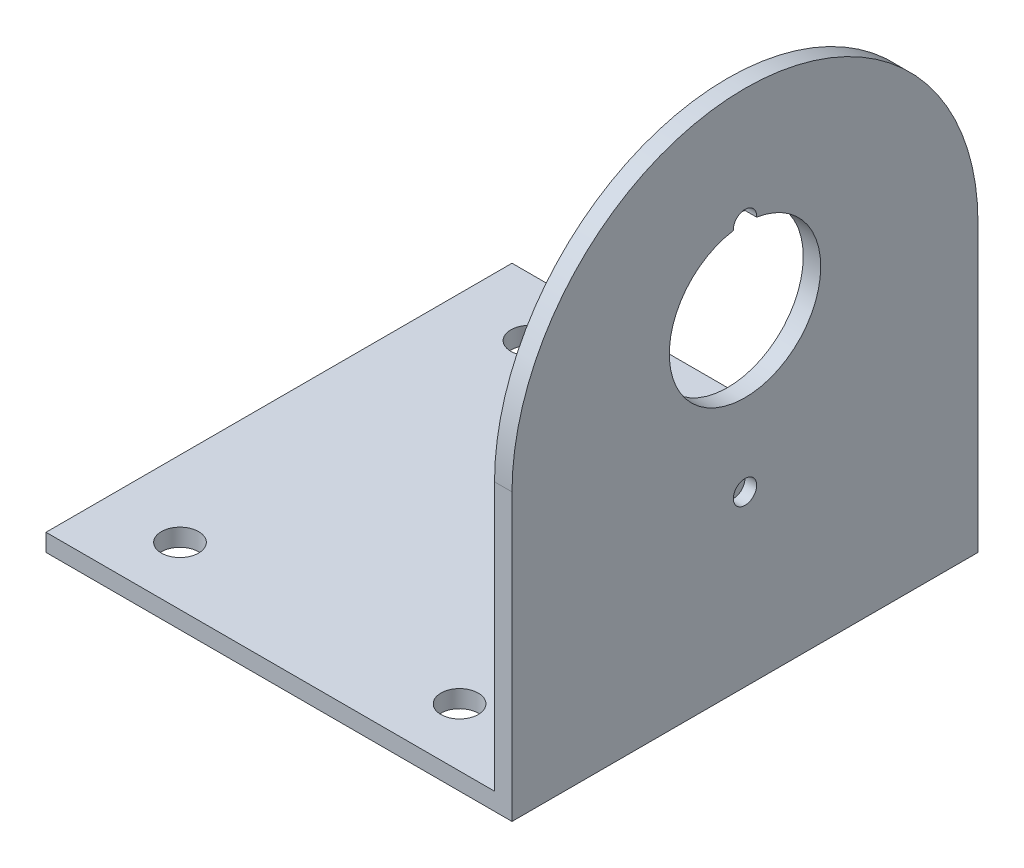
ISO-10303-21;
HEADER;
FILE_DESCRIPTION(('STEP AP214'),'2;1');
FILE_NAME('part.step','',(''),(''),'','','');
FILE_SCHEMA(('AUTOMOTIVE_DESIGN { 1 0 10303 214 1 1 1 1 }'));
ENDSEC;
DATA;
#1=APPLICATION_CONTEXT('core data for automotive mechanical design processes');
#2=APPLICATION_PROTOCOL_DEFINITION('international standard','automotive_design',2000,#1);
#3=PRODUCT_CONTEXT('',#1,'mechanical');
#4=PRODUCT('Part','Part','',(#3));
#5=PRODUCT_RELATED_PRODUCT_CATEGORY('part','',(#4));
#6=PRODUCT_DEFINITION_FORMATION('','',#4);
#7=PRODUCT_DEFINITION_CONTEXT('part definition',#1,'design');
#8=PRODUCT_DEFINITION('design','',#6,#7);
#9=PRODUCT_DEFINITION_SHAPE('','',#8);
#10=(LENGTH_UNIT() NAMED_UNIT(*) SI_UNIT(.MILLI.,.METRE.));
#11=(NAMED_UNIT(*) PLANE_ANGLE_UNIT() SI_UNIT($,.RADIAN.));
#12=(NAMED_UNIT(*) SI_UNIT($,.STERADIAN.) SOLID_ANGLE_UNIT());
#13=UNCERTAINTY_MEASURE_WITH_UNIT(LENGTH_MEASURE(1.E-05),#10,'distance_accuracy_value','');
#14=(GEOMETRIC_REPRESENTATION_CONTEXT(3) GLOBAL_UNCERTAINTY_ASSIGNED_CONTEXT((#13)) GLOBAL_UNIT_ASSIGNED_CONTEXT((#10,
#11,#12)) REPRESENTATION_CONTEXT('',''));
#15=CARTESIAN_POINT('',(0.,0.,0.));
#16=DIRECTION('',(0.,0.,1.));
#17=DIRECTION('',(1.,0.,0.));
#18=AXIS2_PLACEMENT_3D('',#15,#16,#17);
#19=CARTESIAN_POINT('',(0.,1.5,0.));
#20=DIRECTION('',(0.,1.,0.));
#21=DIRECTION('',(0.,0.,1.));
#22=AXIS2_PLACEMENT_3D('',#19,#20,#21);
#23=PLANE('',#22);
#24=CARTESIAN_POINT('',(5.49999999999999,1.5,-7.5));
#25=DIRECTION('',(0.,1.,0.));
#26=DIRECTION('',(0.,0.,1.));
#27=AXIS2_PLACEMENT_3D('',#24,#25,#26);
#28=CIRCLE('',#27,1.6);
#29=CARTESIAN_POINT('',(5.49999999999999,1.5,-5.9));
#30=VERTEX_POINT('',#29);
#31=EDGE_CURVE('E153',#30,#30,#28,.T.);
#32=ORIENTED_EDGE('',*,*,#31,.F.);
#33=EDGE_LOOP('',(#32));
#34=FACE_BOUND('',#33,.T.);
#35=CARTESIAN_POINT('',(-18.5,1.5,22.5));
#36=DIRECTION('',(0.,1.,0.));
#37=DIRECTION('',(0.,0.,1.));
#38=AXIS2_PLACEMENT_3D('',#35,#36,#37);
#39=CIRCLE('',#38,1.6);
#40=CARTESIAN_POINT('',(-18.5,1.5,24.1));
#41=VERTEX_POINT('',#40);
#42=EDGE_CURVE('E150',#41,#41,#39,.T.);
#43=ORIENTED_EDGE('',*,*,#42,.F.);
#44=EDGE_LOOP('',(#43));
#45=FACE_BOUND('',#44,.T.);
#46=CARTESIAN_POINT('',(-18.5,1.5,-7.5));
#47=DIRECTION('',(0.,1.,0.));
#48=DIRECTION('',(0.,0.,1.));
#49=AXIS2_PLACEMENT_3D('',#46,#47,#48);
#50=CIRCLE('',#49,1.6);
#51=CARTESIAN_POINT('',(-18.5,1.5,-5.9));
#52=VERTEX_POINT('',#51);
#53=EDGE_CURVE('E147',#52,#52,#50,.T.);
#54=ORIENTED_EDGE('',*,*,#53,.F.);
#55=EDGE_LOOP('',(#54));
#56=FACE_BOUND('',#55,.T.);
#57=CARTESIAN_POINT('',(5.49999999999999,1.5,22.5));
#58=DIRECTION('',(0.,1.,0.));
#59=DIRECTION('',(0.,0.,1.));
#60=AXIS2_PLACEMENT_3D('',#57,#58,#59);
#61=CIRCLE('',#60,1.6);
#62=CARTESIAN_POINT('',(5.49999999999999,1.5,24.1));
#63=VERTEX_POINT('',#62);
#64=EDGE_CURVE('E144',#63,#63,#61,.T.);
#65=ORIENTED_EDGE('',*,*,#64,.F.);
#66=EDGE_LOOP('',(#65));
#67=FACE_BOUND('',#66,.T.);
#68=DIRECTION('',(1.,0.,0.));
#69=VECTOR('',#68,1.);
#70=CARTESIAN_POINT('',(15.,1.5,27.5));
#71=LINE('',#70,#69);
#72=CARTESIAN_POINT('',(-25.,1.5,27.5));
#73=VERTEX_POINT('',#72);
#74=CARTESIAN_POINT('',(13.5,1.5,27.5));
#75=VERTEX_POINT('',#74);
#76=EDGE_CURVE('E178',#73,#75,#71,.T.);
#77=ORIENTED_EDGE('',*,*,#76,.T.);
#78=DIRECTION('',(0.,0.,-1.));
#79=VECTOR('',#78,1.);
#80=CARTESIAN_POINT('',(13.5,1.5,27.5));
#81=LINE('',#80,#79);
#82=CARTESIAN_POINT('',(13.5,1.5,-12.5));
#83=VERTEX_POINT('',#82);
#84=EDGE_CURVE('E160',#75,#83,#81,.T.);
#85=ORIENTED_EDGE('',*,*,#84,.T.);
#86=DIRECTION('',(-1.,0.,0.));
#87=VECTOR('',#86,1.);
#88=CARTESIAN_POINT('',(15.,1.5,-12.5));
#89=LINE('',#88,#87);
#90=CARTESIAN_POINT('',(-25.,1.5,-12.5));
#91=VERTEX_POINT('',#90);
#92=EDGE_CURVE('E182',#83,#91,#89,.T.);
#93=ORIENTED_EDGE('',*,*,#92,.T.);
#94=DIRECTION('',(0.,0.,1.));
#95=VECTOR('',#94,1.);
#96=CARTESIAN_POINT('',(-25.,1.5,27.5));
#97=LINE('',#96,#95);
#98=EDGE_CURVE('E175',#91,#73,#97,.T.);
#99=ORIENTED_EDGE('',*,*,#98,.T.);
#100=EDGE_LOOP('',(#77,#85,#93,#99));
#101=FACE_BOUND('',#100,.T.);
#102=ADVANCED_FACE('F42',(#34,#45,#56,#67,#101),#23,.T.);
#103=CARTESIAN_POINT('',(-25.,1.5,27.5));
#104=DIRECTION('',(1.,0.,0.));
#105=DIRECTION('',(0.,0.,-1.));
#106=AXIS2_PLACEMENT_3D('',#103,#104,#105);
#107=PLANE('',#106);
#108=DIRECTION('',(0.,0.,1.));
#109=VECTOR('',#108,1.);
#110=CARTESIAN_POINT('',(-25.,0.,27.5));
#111=LINE('',#110,#109);
#112=CARTESIAN_POINT('',(-25.,0.,-12.5));
#113=VERTEX_POINT('',#112);
#114=CARTESIAN_POINT('',(-25.,0.,27.5));
#115=VERTEX_POINT('',#114);
#116=EDGE_CURVE('E172',#113,#115,#111,.T.);
#117=ORIENTED_EDGE('',*,*,#116,.T.);
#118=DIRECTION('',(0.,-1.,0.));
#119=VECTOR('',#118,1.);
#120=CARTESIAN_POINT('',(-25.,1.5,27.5));
#121=LINE('',#120,#119);
#122=EDGE_CURVE('E200',#73,#115,#121,.T.);
#123=ORIENTED_EDGE('',*,*,#122,.F.);
#124=ORIENTED_EDGE('',*,*,#98,.F.);
#125=DIRECTION('',(0.,-1.,0.));
#126=VECTOR('',#125,1.);
#127=CARTESIAN_POINT('',(-25.,1.5,-12.5));
#128=LINE('',#127,#126);
#129=EDGE_CURVE('E184',#91,#113,#128,.T.);
#130=ORIENTED_EDGE('',*,*,#129,.T.);
#131=EDGE_LOOP('',(#117,#123,#124,#130));
#132=FACE_BOUND('',#131,.T.);
#133=ADVANCED_FACE('F44',(#132),#107,.F.);
#134=CARTESIAN_POINT('',(15.,1.5,27.5));
#135=DIRECTION('',(0.,0.,-1.));
#136=DIRECTION('',(-1.,0.,0.));
#137=AXIS2_PLACEMENT_3D('',#134,#135,#136);
#138=PLANE('',#137);
#139=DIRECTION('',(1.,0.,0.));
#140=VECTOR('',#139,1.);
#141=CARTESIAN_POINT('',(15.,0.,27.5));
#142=LINE('',#141,#140);
#143=CARTESIAN_POINT('',(15.,0.,27.5));
#144=VERTEX_POINT('',#143);
#145=EDGE_CURVE('E187',#115,#144,#142,.T.);
#146=ORIENTED_EDGE('',*,*,#145,.T.);
#147=DIRECTION('',(0.,-1.,0.));
#148=VECTOR('',#147,1.);
#149=CARTESIAN_POINT('',(15.,1.5,27.5));
#150=LINE('',#149,#148);
#151=CARTESIAN_POINT('',(15.,24.5,27.5));
#152=VERTEX_POINT('',#151);
#153=EDGE_CURVE('E197',#152,#144,#150,.T.);
#154=ORIENTED_EDGE('',*,*,#153,.F.);
#155=DIRECTION('',(1.,0.,0.));
#156=VECTOR('',#155,1.);
#157=CARTESIAN_POINT('',(13.5,24.5,27.5));
#158=LINE('',#157,#156);
#159=CARTESIAN_POINT('',(13.5,24.5,27.5));
#160=VERTEX_POINT('',#159);
#161=EDGE_CURVE('E169',#160,#152,#158,.T.);
#162=ORIENTED_EDGE('',*,*,#161,.F.);
#163=DIRECTION('',(0.,-1.,0.));
#164=VECTOR('',#163,1.);
#165=CARTESIAN_POINT('',(13.5,24.5,27.5));
#166=LINE('',#165,#164);
#167=EDGE_CURVE('E157',#160,#75,#166,.T.);
#168=ORIENTED_EDGE('',*,*,#167,.T.);
#169=ORIENTED_EDGE('',*,*,#76,.F.);
#170=ORIENTED_EDGE('',*,*,#122,.T.);
#171=EDGE_LOOP('',(#146,#154,#162,#168,#169,#170));
#172=FACE_BOUND('',#171,.T.);
#173=ADVANCED_FACE('F205',(#172),#138,.F.);
#174=CARTESIAN_POINT('',(15.,1.5,27.5));
#175=DIRECTION('',(-1.,0.,0.));
#176=DIRECTION('',(0.,0.,1.));
#177=AXIS2_PLACEMENT_3D('',#174,#175,#176);
#178=PLANE('',#177);
#179=CARTESIAN_POINT('',(15.,14.5,7.5));
#180=DIRECTION('',(1.,0.,0.));
#181=DIRECTION('',(0.,0.,-1.));
#182=AXIS2_PLACEMENT_3D('',#179,#180,#181);
#183=CIRCLE('',#182,1.);
#184=CARTESIAN_POINT('',(15.,14.5,6.5));
#185=VERTEX_POINT('',#184);
#186=EDGE_CURVE('E114',#185,#185,#183,.T.);
#187=ORIENTED_EDGE('',*,*,#186,.F.);
#188=EDGE_LOOP('',(#187));
#189=FACE_BOUND('',#188,.T.);
#190=CARTESIAN_POINT('',(15.,28.,7.5));
#191=DIRECTION('',(1.,0.,0.));
#192=DIRECTION('',(0.,0.,-1.));
#193=AXIS2_PLACEMENT_3D('',#190,#191,#192);
#194=CIRCLE('',#193,6.5);
#195=CARTESIAN_POINT('',(15.,34.4230769230769,8.49703703052436));
#196=VERTEX_POINT('',#195);
#197=CARTESIAN_POINT('',(15.,34.4230769230769,6.50296296947577));
#198=VERTEX_POINT('',#197);
#199=EDGE_CURVE('E119',#196,#198,#194,.T.);
#200=ORIENTED_EDGE('',*,*,#199,.F.);
#201=CARTESIAN_POINT('',(15.,34.4999999999999,7.50000000000007));
#202=DIRECTION('',(1.,0.,0.));
#203=DIRECTION('',(0.,0.,1.));
#204=AXIS2_PLACEMENT_3D('',#201,#202,#203);
#205=CIRCLE('',#204,0.999999999999998);
#206=EDGE_CURVE('E107',#198,#196,#205,.T.);
#207=ORIENTED_EDGE('',*,*,#206,.F.);
#208=EDGE_LOOP('',(#200,#207));
#209=FACE_BOUND('',#208,.T.);
#210=DIRECTION('',(0.,0.,-1.));
#211=VECTOR('',#210,1.);
#212=CARTESIAN_POINT('',(15.,0.,27.5));
#213=LINE('',#212,#211);
#214=CARTESIAN_POINT('',(15.,0.,-12.5));
#215=VERTEX_POINT('',#214);
#216=EDGE_CURVE('E189',#144,#215,#213,.T.);
#217=ORIENTED_EDGE('',*,*,#216,.T.);
#218=DIRECTION('',(0.,-1.,0.));
#219=VECTOR('',#218,1.);
#220=CARTESIAN_POINT('',(15.,1.5,-12.5));
#221=LINE('',#220,#219);
#222=CARTESIAN_POINT('',(15.,24.5,-12.5));
#223=VERTEX_POINT('',#222);
#224=EDGE_CURVE('E194',#223,#215,#221,.T.);
#225=ORIENTED_EDGE('',*,*,#224,.F.);
#226=CARTESIAN_POINT('',(15.,24.5,7.5));
#227=DIRECTION('',(1.,0.,0.));
#228=DIRECTION('',(0.,0.,-1.));
#229=AXIS2_PLACEMENT_3D('',#226,#227,#228);
#230=CIRCLE('',#229,20.);
#231=EDGE_CURVE('E156',#223,#152,#230,.T.);
#232=ORIENTED_EDGE('',*,*,#231,.T.);
#233=ORIENTED_EDGE('',*,*,#153,.T.);
#234=EDGE_LOOP('',(#217,#225,#232,#233));
#235=FACE_BOUND('',#234,.T.);
#236=ADVANCED_FACE('F121',(#189,#209,#235),#178,.F.);
#237=CARTESIAN_POINT('',(15.,1.5,-12.5));
#238=DIRECTION('',(0.,0.,1.));
#239=DIRECTION('',(1.,0.,0.));
#240=AXIS2_PLACEMENT_3D('',#237,#238,#239);
#241=PLANE('',#240);
#242=DIRECTION('',(-1.,0.,0.));
#243=VECTOR('',#242,1.);
#244=CARTESIAN_POINT('',(15.,0.,-12.5));
#245=LINE('',#244,#243);
#246=EDGE_CURVE('E179',#215,#113,#245,.T.);
#247=ORIENTED_EDGE('',*,*,#246,.T.);
#248=ORIENTED_EDGE('',*,*,#129,.F.);
#249=ORIENTED_EDGE('',*,*,#92,.F.);
#250=DIRECTION('',(0.,1.,0.));
#251=VECTOR('',#250,1.);
#252=CARTESIAN_POINT('',(13.5,1.5,-12.5));
#253=LINE('',#252,#251);
#254=CARTESIAN_POINT('',(13.5,24.5,-12.5));
#255=VERTEX_POINT('',#254);
#256=EDGE_CURVE('E64',#83,#255,#253,.T.);
#257=ORIENTED_EDGE('',*,*,#256,.T.);
#258=DIRECTION('',(1.,0.,0.));
#259=VECTOR('',#258,1.);
#260=CARTESIAN_POINT('',(13.5,24.5,-12.5));
#261=LINE('',#260,#259);
#262=EDGE_CURVE('E166',#255,#223,#261,.T.);
#263=ORIENTED_EDGE('',*,*,#262,.T.);
#264=ORIENTED_EDGE('',*,*,#224,.T.);
#265=EDGE_LOOP('',(#247,#248,#249,#257,#263,#264));
#266=FACE_BOUND('',#265,.T.);
#267=ADVANCED_FACE('F215',(#266),#241,.F.);
#268=CARTESIAN_POINT('',(0.,0.,0.));
#269=DIRECTION('',(0.,1.,0.));
#270=DIRECTION('',(0.,0.,1.));
#271=AXIS2_PLACEMENT_3D('',#268,#269,#270);
#272=PLANE('',#271);
#273=CARTESIAN_POINT('',(5.49999999999999,0.,-7.5));
#274=DIRECTION('',(0.,-1.,0.));
#275=DIRECTION('',(0.,0.,1.));
#276=AXIS2_PLACEMENT_3D('',#273,#274,#275);
#277=CIRCLE('',#276,1.6);
#278=CARTESIAN_POINT('',(5.49999999999999,0.,-5.9));
#279=VERTEX_POINT('',#278);
#280=EDGE_CURVE('E136',#279,#279,#277,.T.);
#281=ORIENTED_EDGE('',*,*,#280,.F.);
#282=EDGE_LOOP('',(#281));
#283=FACE_BOUND('',#282,.T.);
#284=CARTESIAN_POINT('',(-18.5,0.,22.5));
#285=DIRECTION('',(0.,-1.,0.));
#286=DIRECTION('',(0.,0.,-1.));
#287=AXIS2_PLACEMENT_3D('',#284,#285,#286);
#288=CIRCLE('',#287,1.6);
#289=CARTESIAN_POINT('',(-18.5,0.,20.9));
#290=VERTEX_POINT('',#289);
#291=EDGE_CURVE('E135',#290,#290,#288,.T.);
#292=ORIENTED_EDGE('',*,*,#291,.F.);
#293=EDGE_LOOP('',(#292));
#294=FACE_BOUND('',#293,.T.);
#295=CARTESIAN_POINT('',(-18.5,0.,-7.5));
#296=DIRECTION('',(0.,-1.,0.));
#297=DIRECTION('',(0.,0.,1.));
#298=AXIS2_PLACEMENT_3D('',#295,#296,#297);
#299=CIRCLE('',#298,1.6);
#300=CARTESIAN_POINT('',(-18.5,0.,-5.9));
#301=VERTEX_POINT('',#300);
#302=EDGE_CURVE('E127',#301,#301,#299,.T.);
#303=ORIENTED_EDGE('',*,*,#302,.F.);
#304=EDGE_LOOP('',(#303));
#305=FACE_BOUND('',#304,.T.);
#306=CARTESIAN_POINT('',(5.49999999999999,0.,22.5));
#307=DIRECTION('',(0.,-1.,0.));
#308=DIRECTION('',(0.,0.,-1.));
#309=AXIS2_PLACEMENT_3D('',#306,#307,#308);
#310=CIRCLE('',#309,1.6);
#311=CARTESIAN_POINT('',(5.49999999999999,0.,20.9));
#312=VERTEX_POINT('',#311);
#313=EDGE_CURVE('E139',#312,#312,#310,.T.);
#314=ORIENTED_EDGE('',*,*,#313,.F.);
#315=EDGE_LOOP('',(#314));
#316=FACE_BOUND('',#315,.T.);
#317=ORIENTED_EDGE('',*,*,#116,.F.);
#318=ORIENTED_EDGE('',*,*,#246,.F.);
#319=ORIENTED_EDGE('',*,*,#216,.F.);
#320=ORIENTED_EDGE('',*,*,#145,.F.);
#321=EDGE_LOOP('',(#317,#318,#319,#320));
#322=FACE_BOUND('',#321,.T.);
#323=ADVANCED_FACE('F212',(#283,#294,#305,#316,#322),#272,.F.);
#324=CARTESIAN_POINT('',(13.5,24.5,7.5));
#325=DIRECTION('',(1.,0.,0.));
#326=DIRECTION('',(0.,0.,-1.));
#327=AXIS2_PLACEMENT_3D('',#324,#325,#326);
#328=CYLINDRICAL_SURFACE('',#327,20.);
#329=ORIENTED_EDGE('',*,*,#231,.F.);
#330=ORIENTED_EDGE('',*,*,#262,.F.);
#331=CARTESIAN_POINT('',(13.5,24.5,7.5));
#332=DIRECTION('',(1.,0.,0.));
#333=DIRECTION('',(0.,0.,-1.));
#334=AXIS2_PLACEMENT_3D('',#331,#332,#333);
#335=CIRCLE('',#334,20.);
#336=EDGE_CURVE('E163',#255,#160,#335,.T.);
#337=ORIENTED_EDGE('',*,*,#336,.T.);
#338=ORIENTED_EDGE('',*,*,#161,.T.);
#339=EDGE_LOOP('',(#329,#330,#337,#338));
#340=FACE_BOUND('',#339,.T.);
#341=ADVANCED_FACE('F219',(#340),#328,.T.);
#342=CARTESIAN_POINT('',(13.5,24.5,7.5));
#343=DIRECTION('',(1.,0.,0.));
#344=DIRECTION('',(0.,0.,-1.));
#345=AXIS2_PLACEMENT_3D('',#342,#343,#344);
#346=PLANE('',#345);
#347=CARTESIAN_POINT('',(13.5,28.,7.5));
#348=DIRECTION('',(1.,0.,0.));
#349=DIRECTION('',(0.,0.,-1.));
#350=AXIS2_PLACEMENT_3D('',#347,#348,#349);
#351=CIRCLE('',#350,6.5);
#352=CARTESIAN_POINT('',(13.5,28.,0.999999999999999));
#353=VERTEX_POINT('',#352);
#354=EDGE_CURVE('E123',#353,#353,#351,.T.);
#355=ORIENTED_EDGE('',*,*,#354,.T.);
#356=EDGE_LOOP('',(#355));
#357=FACE_BOUND('',#356,.T.);
#358=ORIENTED_EDGE('',*,*,#167,.F.);
#359=ORIENTED_EDGE('',*,*,#336,.F.);
#360=ORIENTED_EDGE('',*,*,#256,.F.);
#361=ORIENTED_EDGE('',*,*,#84,.F.);
#362=EDGE_LOOP('',(#358,#359,#360,#361));
#363=FACE_BOUND('',#362,.T.);
#364=ADVANCED_FACE('F221',(#357,#363),#346,.F.);
#365=CARTESIAN_POINT('',(5.49999999999999,44.5,22.5));
#366=DIRECTION('',(0.,-1.,0.));
#367=DIRECTION('',(0.,0.,-1.));
#368=AXIS2_PLACEMENT_3D('',#365,#366,#367);
#369=CYLINDRICAL_SURFACE('',#368,1.6);
#370=ORIENTED_EDGE('',*,*,#64,.T.);
#371=EDGE_LOOP('',(#370));
#372=FACE_BOUND('',#371,.T.);
#373=ORIENTED_EDGE('',*,*,#313,.T.);
#374=EDGE_LOOP('',(#373));
#375=FACE_BOUND('',#374,.T.);
#376=ADVANCED_FACE('F274',(#372,#375),#369,.F.);
#377=CARTESIAN_POINT('',(-18.5,44.5,-7.5));
#378=DIRECTION('',(0.,-1.,0.));
#379=DIRECTION('',(0.,0.,-1.));
#380=AXIS2_PLACEMENT_3D('',#377,#378,#379);
#381=CYLINDRICAL_SURFACE('',#380,1.6);
#382=ORIENTED_EDGE('',*,*,#53,.T.);
#383=EDGE_LOOP('',(#382));
#384=FACE_BOUND('',#383,.T.);
#385=ORIENTED_EDGE('',*,*,#302,.T.);
#386=EDGE_LOOP('',(#385));
#387=FACE_BOUND('',#386,.T.);
#388=ADVANCED_FACE('F281',(#384,#387),#381,.F.);
#389=CARTESIAN_POINT('',(-18.5,44.5,22.5));
#390=DIRECTION('',(0.,-1.,0.));
#391=DIRECTION('',(0.,0.,-1.));
#392=AXIS2_PLACEMENT_3D('',#389,#390,#391);
#393=CYLINDRICAL_SURFACE('',#392,1.6);
#394=ORIENTED_EDGE('',*,*,#42,.T.);
#395=EDGE_LOOP('',(#394));
#396=FACE_BOUND('',#395,.T.);
#397=ORIENTED_EDGE('',*,*,#291,.T.);
#398=EDGE_LOOP('',(#397));
#399=FACE_BOUND('',#398,.T.);
#400=ADVANCED_FACE('F289',(#396,#399),#393,.F.);
#401=CARTESIAN_POINT('',(5.49999999999999,44.5,-7.5));
#402=DIRECTION('',(0.,-1.,0.));
#403=DIRECTION('',(0.,0.,-1.));
#404=AXIS2_PLACEMENT_3D('',#401,#402,#403);
#405=CYLINDRICAL_SURFACE('',#404,1.6);
#406=ORIENTED_EDGE('',*,*,#31,.T.);
#407=EDGE_LOOP('',(#406));
#408=FACE_BOUND('',#407,.T.);
#409=ORIENTED_EDGE('',*,*,#280,.T.);
#410=EDGE_LOOP('',(#409));
#411=FACE_BOUND('',#410,.T.);
#412=ADVANCED_FACE('F297',(#408,#411),#405,.F.);
#413=CARTESIAN_POINT('',(-25.,28.,7.5));
#414=DIRECTION('',(1.,0.,0.));
#415=DIRECTION('',(0.,0.,-1.));
#416=AXIS2_PLACEMENT_3D('',#413,#414,#415);
#417=CYLINDRICAL_SURFACE('',#416,6.5);
#418=CARTESIAN_POINT('',(14.,28.,7.5));
#419=DIRECTION('',(-1.,0.,0.));
#420=DIRECTION('',(0.,0.,1.));
#421=AXIS2_PLACEMENT_3D('',#418,#419,#420);
#422=CIRCLE('',#421,6.5);
#423=CARTESIAN_POINT('',(14.,34.4230769230769,6.50296296947577));
#424=VERTEX_POINT('',#423);
#425=CARTESIAN_POINT('',(14.,34.4230769230769,8.49703703052436));
#426=VERTEX_POINT('',#425);
#427=EDGE_CURVE('E120',#424,#426,#422,.F.);
#428=ORIENTED_EDGE('',*,*,#427,.T.);
#429=DIRECTION('',(1.,0.,0.));
#430=VECTOR('',#429,1.);
#431=CARTESIAN_POINT('',(14.5,34.4230769230769,8.49703703052436));
#432=LINE('',#431,#430);
#433=EDGE_CURVE('E11',#426,#196,#432,.T.);
#434=ORIENTED_EDGE('',*,*,#433,.T.);
#435=ORIENTED_EDGE('',*,*,#199,.T.);
#436=DIRECTION('',(1.,0.,0.));
#437=VECTOR('',#436,1.);
#438=CARTESIAN_POINT('',(14.5,34.4230769230769,6.50296296947577));
#439=LINE('',#438,#437);
#440=EDGE_CURVE('E50',#198,#424,#439,.F.);
#441=ORIENTED_EDGE('',*,*,#440,.T.);
#442=EDGE_LOOP('',(#428,#434,#435,#441));
#443=FACE_BOUND('',#442,.T.);
#444=ORIENTED_EDGE('',*,*,#354,.F.);
#445=EDGE_LOOP('',(#444));
#446=FACE_BOUND('',#445,.T.);
#447=ADVANCED_FACE('F117',(#443,#446),#417,.F.);
#448=CARTESIAN_POINT('',(14.,34.4999999999999,7.50000000000007));
#449=DIRECTION('',(1.,0.,0.));
#450=DIRECTION('',(0.,0.,-1.));
#451=AXIS2_PLACEMENT_3D('',#448,#449,#450);
#452=CYLINDRICAL_SURFACE('',#451,0.999999999999998);
#453=CARTESIAN_POINT('',(14.,34.4999999999999,7.50000000000007));
#454=DIRECTION('',(1.,0.,0.));
#455=DIRECTION('',(0.,0.,1.));
#456=AXIS2_PLACEMENT_3D('',#453,#454,#455);
#457=CIRCLE('',#456,0.999999999999998);
#458=EDGE_CURVE('E56',#424,#426,#457,.T.);
#459=ORIENTED_EDGE('',*,*,#458,.F.);
#460=ORIENTED_EDGE('',*,*,#440,.F.);
#461=ORIENTED_EDGE('',*,*,#206,.T.);
#462=ORIENTED_EDGE('',*,*,#433,.F.);
#463=EDGE_LOOP('',(#459,#460,#461,#462));
#464=FACE_BOUND('',#463,.T.);
#465=ADVANCED_FACE('F108',(#464),#452,.F.);
#466=CARTESIAN_POINT('',(14.,34.4999999999999,7.50000000000007));
#467=DIRECTION('',(-1.,0.,0.));
#468=DIRECTION('',(0.,0.,1.));
#469=AXIS2_PLACEMENT_3D('',#466,#467,#468);
#470=PLANE('',#469);
#471=ORIENTED_EDGE('',*,*,#458,.T.);
#472=ORIENTED_EDGE('',*,*,#427,.F.);
#473=EDGE_LOOP('',(#471,#472));
#474=FACE_BOUND('',#473,.T.);
#475=ADVANCED_FACE('F320',(#474),#470,.F.);
#476=CARTESIAN_POINT('',(14.,14.5,7.5));
#477=DIRECTION('',(1.,0.,0.));
#478=DIRECTION('',(0.,0.,-1.));
#479=AXIS2_PLACEMENT_3D('',#476,#477,#478);
#480=CYLINDRICAL_SURFACE('',#479,1.);
#481=CARTESIAN_POINT('',(14.,14.5,7.5));
#482=DIRECTION('',(1.,0.,0.));
#483=DIRECTION('',(0.,0.,-1.));
#484=AXIS2_PLACEMENT_3D('',#481,#482,#483);
#485=CIRCLE('',#484,1.);
#486=CARTESIAN_POINT('',(14.,14.5,6.5));
#487=VERTEX_POINT('',#486);
#488=EDGE_CURVE('E124',#487,#487,#485,.T.);
#489=ORIENTED_EDGE('',*,*,#488,.F.);
#490=EDGE_LOOP('',(#489));
#491=FACE_BOUND('',#490,.T.);
#492=ORIENTED_EDGE('',*,*,#186,.T.);
#493=EDGE_LOOP('',(#492));
#494=FACE_BOUND('',#493,.T.);
#495=ADVANCED_FACE('F326',(#491,#494),#480,.F.);
#496=CARTESIAN_POINT('',(14.,14.5,7.5));
#497=DIRECTION('',(1.,0.,0.));
#498=DIRECTION('',(0.,0.,-1.));
#499=AXIS2_PLACEMENT_3D('',#496,#497,#498);
#500=PLANE('',#499);
#501=ORIENTED_EDGE('',*,*,#488,.T.);
#502=EDGE_LOOP('',(#501));
#503=FACE_BOUND('',#502,.T.);
#504=ADVANCED_FACE('F333',(#503),#500,.T.);
#505=CLOSED_SHELL('',(#102,#133,#173,#236,#267,#323,#341,#364,#376,#388,#400,#412,#447,#465,
#475,#495,#504));
#506=MANIFOLD_SOLID_BREP('B2',#505);
#507=ADVANCED_BREP_SHAPE_REPRESENTATION('',(#18,#506),#14);
#508=SHAPE_DEFINITION_REPRESENTATION(#9,#507);
ENDSEC;
END-ISO-10303-21;
